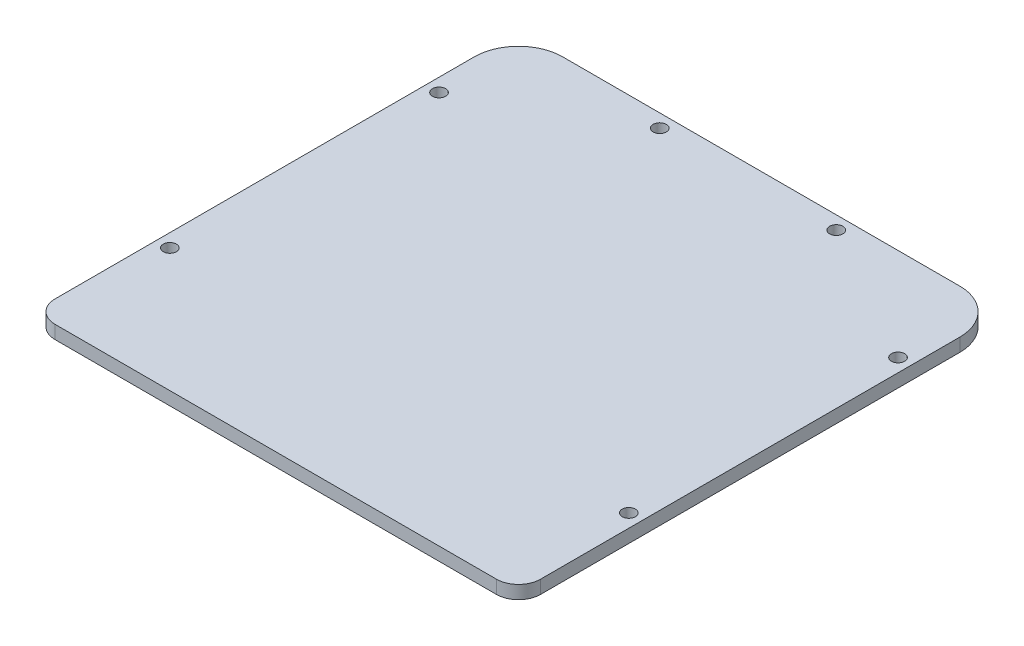
ISO-10303-21;
HEADER;
FILE_DESCRIPTION(('STEP AP214'),'2;1');
FILE_NAME('part.step','',(''),(''),'','','');
FILE_SCHEMA(('AUTOMOTIVE_DESIGN { 1 0 10303 214 1 1 1 1 }'));
ENDSEC;
DATA;
#1=APPLICATION_CONTEXT('core data for automotive mechanical design processes');
#2=APPLICATION_PROTOCOL_DEFINITION('international standard','automotive_design',2000,#1);
#3=PRODUCT_CONTEXT('',#1,'mechanical');
#4=PRODUCT('Part','Part','',(#3));
#5=PRODUCT_RELATED_PRODUCT_CATEGORY('part','',(#4));
#6=PRODUCT_DEFINITION_FORMATION('','',#4);
#7=PRODUCT_DEFINITION_CONTEXT('part definition',#1,'design');
#8=PRODUCT_DEFINITION('design','',#6,#7);
#9=PRODUCT_DEFINITION_SHAPE('','',#8);
#10=(LENGTH_UNIT() NAMED_UNIT(*) SI_UNIT(.MILLI.,.METRE.));
#11=(NAMED_UNIT(*) PLANE_ANGLE_UNIT() SI_UNIT($,.RADIAN.));
#12=(NAMED_UNIT(*) SI_UNIT($,.STERADIAN.) SOLID_ANGLE_UNIT());
#13=UNCERTAINTY_MEASURE_WITH_UNIT(LENGTH_MEASURE(1.E-05),#10,'distance_accuracy_value','');
#14=(GEOMETRIC_REPRESENTATION_CONTEXT(3) GLOBAL_UNCERTAINTY_ASSIGNED_CONTEXT((#13)) GLOBAL_UNIT_ASSIGNED_CONTEXT((#10,
#11,#12)) REPRESENTATION_CONTEXT('',''));
#15=CARTESIAN_POINT('',(0.,0.,0.));
#16=DIRECTION('',(0.,0.,1.));
#17=DIRECTION('',(1.,0.,0.));
#18=AXIS2_PLACEMENT_3D('',#15,#16,#17);
#19=CARTESIAN_POINT('',(45.3648924175193,-217.61956551421,-188.830274816639));
#20=DIRECTION('',(0.,-1.,0.));
#21=DIRECTION('',(0.,0.,-1.));
#22=AXIS2_PLACEMENT_3D('',#19,#20,#21);
#23=CYLINDRICAL_SURFACE('',#22,5.);
#24=CARTESIAN_POINT('',(45.3648924175193,-220.61956551421,-188.830274816639));
#25=DIRECTION('',(0.,1.,0.));
#26=DIRECTION('',(0.,0.,1.));
#27=AXIS2_PLACEMENT_3D('',#24,#25,#26);
#28=CIRCLE('',#27,5.);
#29=CARTESIAN_POINT('',(45.3648924175193,-220.61956551421,-183.830274816639));
#30=VERTEX_POINT('',#29);
#31=CARTESIAN_POINT('',(50.3648924175193,-220.61956551421,-188.830274816639));
#32=VERTEX_POINT('',#31);
#33=EDGE_CURVE('E131',#30,#32,#28,.T.);
#34=ORIENTED_EDGE('',*,*,#33,.T.);
#35=DIRECTION('',(0.,-1.,0.));
#36=VECTOR('',#35,1.);
#37=CARTESIAN_POINT('',(50.3648924175193,-217.61956551421,-188.830274816639));
#38=LINE('',#37,#36);
#39=CARTESIAN_POINT('',(50.3648924175193,-217.61956551421,-188.830274816639));
#40=VERTEX_POINT('',#39);
#41=EDGE_CURVE('E11',#40,#32,#38,.T.);
#42=ORIENTED_EDGE('',*,*,#41,.F.);
#43=CARTESIAN_POINT('',(45.3648924175193,-217.61956551421,-188.830274816639));
#44=DIRECTION('',(0.,1.,0.));
#45=DIRECTION('',(0.,0.,1.));
#46=AXIS2_PLACEMENT_3D('',#43,#44,#45);
#47=CIRCLE('',#46,5.);
#48=CARTESIAN_POINT('',(45.3648924175193,-217.61956551421,-183.830274816639));
#49=VERTEX_POINT('',#48);
#50=EDGE_CURVE('E146',#49,#40,#47,.T.);
#51=ORIENTED_EDGE('',*,*,#50,.F.);
#52=DIRECTION('',(0.,-1.,0.));
#53=VECTOR('',#52,1.);
#54=CARTESIAN_POINT('',(45.3648924175193,-217.61956551421,-183.830274816639));
#55=LINE('',#54,#53);
#56=EDGE_CURVE('E127',#49,#30,#55,.T.);
#57=ORIENTED_EDGE('',*,*,#56,.T.);
#58=EDGE_LOOP('',(#34,#42,#51,#57));
#59=FACE_BOUND('',#58,.T.);
#60=ADVANCED_FACE('F35',(#59),#23,.T.);
#61=CARTESIAN_POINT('',(50.3648924175193,-217.61956551421,-283.830274816639));
#62=DIRECTION('',(-1.,0.,0.));
#63=DIRECTION('',(0.,0.,1.));
#64=AXIS2_PLACEMENT_3D('',#61,#62,#63);
#65=PLANE('',#64);
#66=DIRECTION('',(0.,0.,-1.));
#67=VECTOR('',#66,1.);
#68=CARTESIAN_POINT('',(50.3648924175193,-220.61956551421,-283.830274816639));
#69=LINE('',#68,#67);
#70=CARTESIAN_POINT('',(50.3648924175193,-220.61956551421,-283.830274816639));
#71=VERTEX_POINT('',#70);
#72=EDGE_CURVE('E134',#32,#71,#69,.T.);
#73=ORIENTED_EDGE('',*,*,#72,.T.);
#74=DIRECTION('',(0.,-1.,0.));
#75=VECTOR('',#74,1.);
#76=CARTESIAN_POINT('',(50.3648924175193,-217.61956551421,-283.830274816639));
#77=LINE('',#76,#75);
#78=CARTESIAN_POINT('',(50.3648924175193,-217.61956551421,-283.830274816639));
#79=VERTEX_POINT('',#78);
#80=EDGE_CURVE('E43',#79,#71,#77,.T.);
#81=ORIENTED_EDGE('',*,*,#80,.F.);
#82=DIRECTION('',(0.,0.,-1.));
#83=VECTOR('',#82,1.);
#84=CARTESIAN_POINT('',(50.3648924175193,-217.61956551421,-283.830274816639));
#85=LINE('',#84,#83);
#86=EDGE_CURVE('E94',#40,#79,#85,.T.);
#87=ORIENTED_EDGE('',*,*,#86,.F.);
#88=ORIENTED_EDGE('',*,*,#41,.T.);
#89=EDGE_LOOP('',(#73,#81,#87,#88));
#90=FACE_BOUND('',#89,.T.);
#91=ADVANCED_FACE('F243',(#90),#65,.F.);
#92=CARTESIAN_POINT('',(40.3648924175193,-217.61956551421,-283.830274816639));
#93=DIRECTION('',(0.,-1.,0.));
#94=DIRECTION('',(0.,0.,-1.));
#95=AXIS2_PLACEMENT_3D('',#92,#93,#94);
#96=CYLINDRICAL_SURFACE('',#95,10.);
#97=CARTESIAN_POINT('',(40.3648924175193,-220.61956551421,-283.830274816639));
#98=DIRECTION('',(0.,1.,0.));
#99=DIRECTION('',(0.,0.,-1.));
#100=AXIS2_PLACEMENT_3D('',#97,#98,#99);
#101=CIRCLE('',#100,10.);
#102=CARTESIAN_POINT('',(40.3648924175193,-220.61956551421,-293.830274816639));
#103=VERTEX_POINT('',#102);
#104=EDGE_CURVE('E137',#71,#103,#101,.T.);
#105=ORIENTED_EDGE('',*,*,#104,.T.);
#106=DIRECTION('',(0.,-1.,0.));
#107=VECTOR('',#106,1.);
#108=CARTESIAN_POINT('',(40.3648924175193,-217.61956551421,-293.830274816639));
#109=LINE('',#108,#107);
#110=CARTESIAN_POINT('',(40.3648924175193,-217.61956551421,-293.830274816639));
#111=VERTEX_POINT('',#110);
#112=EDGE_CURVE('E153',#111,#103,#109,.T.);
#113=ORIENTED_EDGE('',*,*,#112,.F.);
#114=CARTESIAN_POINT('',(40.3648924175193,-217.61956551421,-283.830274816639));
#115=DIRECTION('',(0.,1.,0.));
#116=DIRECTION('',(0.,0.,-1.));
#117=AXIS2_PLACEMENT_3D('',#114,#115,#116);
#118=CIRCLE('',#117,10.);
#119=EDGE_CURVE('E161',#79,#111,#118,.T.);
#120=ORIENTED_EDGE('',*,*,#119,.F.);
#121=ORIENTED_EDGE('',*,*,#80,.T.);
#122=EDGE_LOOP('',(#105,#113,#120,#121));
#123=FACE_BOUND('',#122,.T.);
#124=ADVANCED_FACE('F159',(#123),#96,.T.);
#125=CARTESIAN_POINT('',(-49.6351075824806,-217.61956551421,-293.830274816639));
#126=DIRECTION('',(0.,0.,1.));
#127=DIRECTION('',(1.,0.,0.));
#128=AXIS2_PLACEMENT_3D('',#125,#126,#127);
#129=PLANE('',#128);
#130=DIRECTION('',(-1.,0.,0.));
#131=VECTOR('',#130,1.);
#132=CARTESIAN_POINT('',(-49.6351075824806,-220.61956551421,-293.830274816639));
#133=LINE('',#132,#131);
#134=CARTESIAN_POINT('',(-49.6351075824806,-220.61956551421,-293.830274816639));
#135=VERTEX_POINT('',#134);
#136=EDGE_CURVE('E139',#103,#135,#133,.T.);
#137=ORIENTED_EDGE('',*,*,#136,.T.);
#138=DIRECTION('',(0.,-1.,0.));
#139=VECTOR('',#138,1.);
#140=CARTESIAN_POINT('',(-49.6351075824806,-217.61956551421,-293.830274816639));
#141=LINE('',#140,#139);
#142=CARTESIAN_POINT('',(-49.6351075824806,-217.61956551421,-293.830274816639));
#143=VERTEX_POINT('',#142);
#144=EDGE_CURVE('E150',#143,#135,#141,.T.);
#145=ORIENTED_EDGE('',*,*,#144,.F.);
#146=DIRECTION('',(-1.,0.,0.));
#147=VECTOR('',#146,1.);
#148=CARTESIAN_POINT('',(-49.6351075824806,-217.61956551421,-293.830274816639));
#149=LINE('',#148,#147);
#150=EDGE_CURVE('E173',#111,#143,#149,.T.);
#151=ORIENTED_EDGE('',*,*,#150,.F.);
#152=ORIENTED_EDGE('',*,*,#112,.T.);
#153=EDGE_LOOP('',(#137,#145,#151,#152));
#154=FACE_BOUND('',#153,.T.);
#155=ADVANCED_FACE('F169',(#154),#129,.F.);
#156=CARTESIAN_POINT('',(-49.6351075824807,-217.61956551421,-283.830274816639));
#157=DIRECTION('',(0.,-1.,0.));
#158=DIRECTION('',(0.,0.,-1.));
#159=AXIS2_PLACEMENT_3D('',#156,#157,#158);
#160=CYLINDRICAL_SURFACE('',#159,10.);
#161=CARTESIAN_POINT('',(-49.6351075824807,-220.61956551421,-283.830274816639));
#162=DIRECTION('',(0.,1.,0.));
#163=DIRECTION('',(0.,0.,1.));
#164=AXIS2_PLACEMENT_3D('',#161,#162,#163);
#165=CIRCLE('',#164,10.);
#166=CARTESIAN_POINT('',(-59.6351075824807,-220.61956551421,-283.830274816639));
#167=VERTEX_POINT('',#166);
#168=EDGE_CURVE('E141',#135,#167,#165,.T.);
#169=ORIENTED_EDGE('',*,*,#168,.T.);
#170=DIRECTION('',(0.,-1.,0.));
#171=VECTOR('',#170,1.);
#172=CARTESIAN_POINT('',(-59.6351075824807,-217.61956551421,-283.830274816639));
#173=LINE('',#172,#171);
#174=CARTESIAN_POINT('',(-59.6351075824807,-217.61956551421,-283.830274816639));
#175=VERTEX_POINT('',#174);
#176=EDGE_CURVE('E122',#175,#167,#173,.T.);
#177=ORIENTED_EDGE('',*,*,#176,.F.);
#178=CARTESIAN_POINT('',(-49.6351075824807,-217.61956551421,-283.830274816639));
#179=DIRECTION('',(0.,1.,0.));
#180=DIRECTION('',(0.,0.,1.));
#181=AXIS2_PLACEMENT_3D('',#178,#179,#180);
#182=CIRCLE('',#181,10.);
#183=EDGE_CURVE('E113',#143,#175,#182,.T.);
#184=ORIENTED_EDGE('',*,*,#183,.F.);
#185=ORIENTED_EDGE('',*,*,#144,.T.);
#186=EDGE_LOOP('',(#169,#177,#184,#185));
#187=FACE_BOUND('',#186,.T.);
#188=ADVANCED_FACE('F172',(#187),#160,.T.);
#189=CARTESIAN_POINT('',(-59.6351075824807,-217.61956551421,-283.830274816639));
#190=DIRECTION('',(1.,0.,0.));
#191=DIRECTION('',(0.,0.,-1.));
#192=AXIS2_PLACEMENT_3D('',#189,#190,#191);
#193=PLANE('',#192);
#194=DIRECTION('',(0.,0.,1.));
#195=VECTOR('',#194,1.);
#196=CARTESIAN_POINT('',(-59.6351075824807,-220.61956551421,-283.830274816639));
#197=LINE('',#196,#195);
#198=CARTESIAN_POINT('',(-59.6351075824807,-220.61956551421,-188.830274816639));
#199=VERTEX_POINT('',#198);
#200=EDGE_CURVE('E121',#167,#199,#197,.T.);
#201=ORIENTED_EDGE('',*,*,#200,.T.);
#202=DIRECTION('',(0.,-1.,0.));
#203=VECTOR('',#202,1.);
#204=CARTESIAN_POINT('',(-59.6351075824807,-217.61956551421,-188.830274816639));
#205=LINE('',#204,#203);
#206=CARTESIAN_POINT('',(-59.6351075824807,-217.61956551421,-188.830274816639));
#207=VERTEX_POINT('',#206);
#208=EDGE_CURVE('E118',#207,#199,#205,.T.);
#209=ORIENTED_EDGE('',*,*,#208,.F.);
#210=DIRECTION('',(0.,0.,1.));
#211=VECTOR('',#210,1.);
#212=CARTESIAN_POINT('',(-59.6351075824807,-217.61956551421,-283.830274816639));
#213=LINE('',#212,#211);
#214=EDGE_CURVE('E107',#175,#207,#213,.T.);
#215=ORIENTED_EDGE('',*,*,#214,.F.);
#216=ORIENTED_EDGE('',*,*,#176,.T.);
#217=EDGE_LOOP('',(#201,#209,#215,#216));
#218=FACE_BOUND('',#217,.T.);
#219=ADVANCED_FACE('F119',(#218),#193,.F.);
#220=CARTESIAN_POINT('',(-54.6351075824807,-217.61956551421,-188.830274816639));
#221=DIRECTION('',(0.,-1.,0.));
#222=DIRECTION('',(0.,0.,-1.));
#223=AXIS2_PLACEMENT_3D('',#220,#221,#222);
#224=CYLINDRICAL_SURFACE('',#223,5.);
#225=CARTESIAN_POINT('',(-54.6351075824807,-220.61956551421,-188.830274816639));
#226=DIRECTION('',(0.,1.,0.));
#227=DIRECTION('',(0.,0.,1.));
#228=AXIS2_PLACEMENT_3D('',#225,#226,#227);
#229=CIRCLE('',#228,5.);
#230=CARTESIAN_POINT('',(-54.6351075824806,-220.61956551421,-183.830274816639));
#231=VERTEX_POINT('',#230);
#232=EDGE_CURVE('E80',#199,#231,#229,.T.);
#233=ORIENTED_EDGE('',*,*,#232,.T.);
#234=DIRECTION('',(0.,-1.,0.));
#235=VECTOR('',#234,1.);
#236=CARTESIAN_POINT('',(-54.6351075824806,-217.61956551421,-183.830274816639));
#237=LINE('',#236,#235);
#238=CARTESIAN_POINT('',(-54.6351075824806,-217.61956551421,-183.830274816639));
#239=VERTEX_POINT('',#238);
#240=EDGE_CURVE('E123',#239,#231,#237,.T.);
#241=ORIENTED_EDGE('',*,*,#240,.F.);
#242=CARTESIAN_POINT('',(-54.6351075824807,-217.61956551421,-188.830274816639));
#243=DIRECTION('',(0.,1.,0.));
#244=DIRECTION('',(0.,0.,1.));
#245=AXIS2_PLACEMENT_3D('',#242,#243,#244);
#246=CIRCLE('',#245,5.);
#247=EDGE_CURVE('E111',#207,#239,#246,.T.);
#248=ORIENTED_EDGE('',*,*,#247,.F.);
#249=ORIENTED_EDGE('',*,*,#208,.T.);
#250=EDGE_LOOP('',(#233,#241,#248,#249));
#251=FACE_BOUND('',#250,.T.);
#252=ADVANCED_FACE('F125',(#251),#224,.T.);
#253=CARTESIAN_POINT('',(-54.6351075824806,-217.61956551421,-183.830274816639));
#254=DIRECTION('',(0.,0.,-1.));
#255=DIRECTION('',(-1.,0.,0.));
#256=AXIS2_PLACEMENT_3D('',#253,#254,#255);
#257=PLANE('',#256);
#258=DIRECTION('',(1.,0.,0.));
#259=VECTOR('',#258,1.);
#260=CARTESIAN_POINT('',(-54.6351075824806,-220.61956551421,-183.830274816639));
#261=LINE('',#260,#259);
#262=EDGE_CURVE('E86',#231,#30,#261,.T.);
#263=ORIENTED_EDGE('',*,*,#262,.T.);
#264=ORIENTED_EDGE('',*,*,#56,.F.);
#265=DIRECTION('',(1.,0.,0.));
#266=VECTOR('',#265,1.);
#267=CARTESIAN_POINT('',(-54.6351075824806,-217.61956551421,-183.830274816639));
#268=LINE('',#267,#266);
#269=EDGE_CURVE('E51',#239,#49,#268,.T.);
#270=ORIENTED_EDGE('',*,*,#269,.F.);
#271=ORIENTED_EDGE('',*,*,#240,.T.);
#272=EDGE_LOOP('',(#263,#264,#270,#271));
#273=FACE_BOUND('',#272,.T.);
#274=ADVANCED_FACE('F227',(#273),#257,.F.);
#275=CARTESIAN_POINT('',(45.3648924175193,-217.61956551421,-188.830274816639));
#276=DIRECTION('',(0.,1.,0.));
#277=DIRECTION('',(0.,0.,1.));
#278=AXIS2_PLACEMENT_3D('',#275,#276,#277);
#279=PLANE('',#278);
#280=CARTESIAN_POINT('',(15.3648924175192,-217.61956551421,-290.833255232378));
#281=DIRECTION('',(0.,1.,0.));
#282=DIRECTION('',(0.,0.,1.));
#283=AXIS2_PLACEMENT_3D('',#280,#281,#282);
#284=CIRCLE('',#283,1.5);
#285=CARTESIAN_POINT('',(15.3648924175192,-217.61956551421,-289.333255232378));
#286=VERTEX_POINT('',#285);
#287=EDGE_CURVE('E204',#286,#286,#284,.T.);
#288=ORIENTED_EDGE('',*,*,#287,.F.);
#289=EDGE_LOOP('',(#288));
#290=FACE_BOUND('',#289,.T.);
#291=CARTESIAN_POINT('',(47.3648924175181,-217.61956551421,-272.830274816639));
#292=DIRECTION('',(0.,1.,0.));
#293=DIRECTION('',(0.,0.,1.));
#294=AXIS2_PLACEMENT_3D('',#291,#292,#293);
#295=CIRCLE('',#294,1.49999999999998);
#296=CARTESIAN_POINT('',(47.3648924175181,-217.61956551421,-271.330274816639));
#297=VERTEX_POINT('',#296);
#298=EDGE_CURVE('E198',#297,#297,#295,.T.);
#299=ORIENTED_EDGE('',*,*,#298,.F.);
#300=EDGE_LOOP('',(#299));
#301=FACE_BOUND('',#300,.T.);
#302=CARTESIAN_POINT('',(47.3648924175193,-217.61956551421,-211.830274816639));
#303=DIRECTION('',(0.,1.,0.));
#304=DIRECTION('',(0.,0.,1.));
#305=AXIS2_PLACEMENT_3D('',#302,#303,#304);
#306=CIRCLE('',#305,1.5);
#307=CARTESIAN_POINT('',(47.3648924175193,-217.61956551421,-210.330274816639));
#308=VERTEX_POINT('',#307);
#309=EDGE_CURVE('E192',#308,#308,#306,.T.);
#310=ORIENTED_EDGE('',*,*,#309,.F.);
#311=EDGE_LOOP('',(#310));
#312=FACE_BOUND('',#311,.T.);
#313=CARTESIAN_POINT('',(-56.6351075824807,-217.61956551421,-211.830274816639));
#314=DIRECTION('',(0.,1.,0.));
#315=DIRECTION('',(0.,0.,1.));
#316=AXIS2_PLACEMENT_3D('',#313,#314,#315);
#317=CIRCLE('',#316,1.5);
#318=CARTESIAN_POINT('',(-56.6351075824807,-217.61956551421,-210.330274816639));
#319=VERTEX_POINT('',#318);
#320=EDGE_CURVE('E185',#319,#319,#317,.T.);
#321=ORIENTED_EDGE('',*,*,#320,.F.);
#322=EDGE_LOOP('',(#321));
#323=FACE_BOUND('',#322,.T.);
#324=CARTESIAN_POINT('',(-56.6351075824807,-217.61956551421,-272.830274816639));
#325=DIRECTION('',(0.,1.,0.));
#326=DIRECTION('',(0.,0.,1.));
#327=AXIS2_PLACEMENT_3D('',#324,#325,#326);
#328=CIRCLE('',#327,1.50000000000001);
#329=CARTESIAN_POINT('',(-56.6351075824807,-217.61956551421,-271.330274816639));
#330=VERTEX_POINT('',#329);
#331=EDGE_CURVE('E209',#330,#330,#328,.T.);
#332=ORIENTED_EDGE('',*,*,#331,.F.);
#333=EDGE_LOOP('',(#332));
#334=FACE_BOUND('',#333,.T.);
#335=CARTESIAN_POINT('',(-24.6351075824807,-217.61956551421,-290.833255232378));
#336=DIRECTION('',(0.,1.,0.));
#337=DIRECTION('',(0.,0.,1.));
#338=AXIS2_PLACEMENT_3D('',#335,#336,#337);
#339=CIRCLE('',#338,1.49999999999997);
#340=CARTESIAN_POINT('',(-24.6351075824807,-217.61956551421,-289.333255232378));
#341=VERTEX_POINT('',#340);
#342=EDGE_CURVE('E179',#341,#341,#339,.T.);
#343=ORIENTED_EDGE('',*,*,#342,.F.);
#344=EDGE_LOOP('',(#343));
#345=FACE_BOUND('',#344,.T.);
#346=ORIENTED_EDGE('',*,*,#50,.T.);
#347=ORIENTED_EDGE('',*,*,#86,.T.);
#348=ORIENTED_EDGE('',*,*,#119,.T.);
#349=ORIENTED_EDGE('',*,*,#150,.T.);
#350=ORIENTED_EDGE('',*,*,#183,.T.);
#351=ORIENTED_EDGE('',*,*,#214,.T.);
#352=ORIENTED_EDGE('',*,*,#247,.T.);
#353=ORIENTED_EDGE('',*,*,#269,.T.);
#354=EDGE_LOOP('',(#346,#347,#348,#349,#350,#351,#352,#353));
#355=FACE_BOUND('',#354,.T.);
#356=ADVANCED_FACE('F109',(#290,#301,#312,#323,#334,#345,#355),#279,.T.);
#357=CARTESIAN_POINT('',(45.3648924175193,-220.61956551421,-188.830274816639));
#358=DIRECTION('',(0.,1.,0.));
#359=DIRECTION('',(0.,0.,1.));
#360=AXIS2_PLACEMENT_3D('',#357,#358,#359);
#361=PLANE('',#360);
#362=CARTESIAN_POINT('',(15.3648924175192,-220.61956551421,-290.833255232378));
#363=DIRECTION('',(0.,1.,0.));
#364=DIRECTION('',(0.,0.,1.));
#365=AXIS2_PLACEMENT_3D('',#362,#363,#364);
#366=CIRCLE('',#365,1.5);
#367=CARTESIAN_POINT('',(15.3648924175192,-220.61956551421,-289.333255232378));
#368=VERTEX_POINT('',#367);
#369=EDGE_CURVE('E182',#368,#368,#366,.T.);
#370=ORIENTED_EDGE('',*,*,#369,.T.);
#371=EDGE_LOOP('',(#370));
#372=FACE_BOUND('',#371,.T.);
#373=CARTESIAN_POINT('',(47.3648924175181,-220.61956551421,-272.830274816639));
#374=DIRECTION('',(0.,1.,0.));
#375=DIRECTION('',(0.,0.,1.));
#376=AXIS2_PLACEMENT_3D('',#373,#374,#375);
#377=CIRCLE('',#376,1.49999999999998);
#378=CARTESIAN_POINT('',(47.3648924175181,-220.61956551421,-271.330274816639));
#379=VERTEX_POINT('',#378);
#380=EDGE_CURVE('E201',#379,#379,#377,.T.);
#381=ORIENTED_EDGE('',*,*,#380,.T.);
#382=EDGE_LOOP('',(#381));
#383=FACE_BOUND('',#382,.T.);
#384=CARTESIAN_POINT('',(47.3648924175193,-220.61956551421,-211.830274816639));
#385=DIRECTION('',(0.,1.,0.));
#386=DIRECTION('',(0.,0.,1.));
#387=AXIS2_PLACEMENT_3D('',#384,#385,#386);
#388=CIRCLE('',#387,1.5);
#389=CARTESIAN_POINT('',(47.3648924175193,-220.61956551421,-210.330274816639));
#390=VERTEX_POINT('',#389);
#391=EDGE_CURVE('E195',#390,#390,#388,.T.);
#392=ORIENTED_EDGE('',*,*,#391,.T.);
#393=EDGE_LOOP('',(#392));
#394=FACE_BOUND('',#393,.T.);
#395=CARTESIAN_POINT('',(-56.6351075824807,-220.61956551421,-211.830274816639));
#396=DIRECTION('',(0.,1.,0.));
#397=DIRECTION('',(0.,0.,1.));
#398=AXIS2_PLACEMENT_3D('',#395,#396,#397);
#399=CIRCLE('',#398,1.5);
#400=CARTESIAN_POINT('',(-56.6351075824807,-220.61956551421,-210.330274816639));
#401=VERTEX_POINT('',#400);
#402=EDGE_CURVE('E188',#401,#401,#399,.T.);
#403=ORIENTED_EDGE('',*,*,#402,.T.);
#404=EDGE_LOOP('',(#403));
#405=FACE_BOUND('',#404,.T.);
#406=CARTESIAN_POINT('',(-56.6351075824807,-220.61956551421,-272.830274816639));
#407=DIRECTION('',(0.,1.,0.));
#408=DIRECTION('',(0.,0.,1.));
#409=AXIS2_PLACEMENT_3D('',#406,#407,#408);
#410=CIRCLE('',#409,1.50000000000001);
#411=CARTESIAN_POINT('',(-56.6351075824807,-220.61956551421,-271.330274816639));
#412=VERTEX_POINT('',#411);
#413=EDGE_CURVE('E189',#412,#412,#410,.T.);
#414=ORIENTED_EDGE('',*,*,#413,.T.);
#415=EDGE_LOOP('',(#414));
#416=FACE_BOUND('',#415,.T.);
#417=CARTESIAN_POINT('',(-24.6351075824807,-220.61956551421,-290.833255232378));
#418=DIRECTION('',(0.,1.,0.));
#419=DIRECTION('',(0.,0.,1.));
#420=AXIS2_PLACEMENT_3D('',#417,#418,#419);
#421=CIRCLE('',#420,1.49999999999997);
#422=CARTESIAN_POINT('',(-24.6351075824807,-220.61956551421,-289.333255232378));
#423=VERTEX_POINT('',#422);
#424=EDGE_CURVE('E135',#423,#423,#421,.T.);
#425=ORIENTED_EDGE('',*,*,#424,.T.);
#426=EDGE_LOOP('',(#425));
#427=FACE_BOUND('',#426,.T.);
#428=ORIENTED_EDGE('',*,*,#33,.F.);
#429=ORIENTED_EDGE('',*,*,#262,.F.);
#430=ORIENTED_EDGE('',*,*,#232,.F.);
#431=ORIENTED_EDGE('',*,*,#200,.F.);
#432=ORIENTED_EDGE('',*,*,#168,.F.);
#433=ORIENTED_EDGE('',*,*,#136,.F.);
#434=ORIENTED_EDGE('',*,*,#104,.F.);
#435=ORIENTED_EDGE('',*,*,#72,.F.);
#436=EDGE_LOOP('',(#428,#429,#430,#431,#432,#433,#434,#435));
#437=FACE_BOUND('',#436,.T.);
#438=ADVANCED_FACE('F165',(#372,#383,#394,#405,#416,#427,#437),#361,.F.);
#439=CARTESIAN_POINT('',(-24.6351075824807,-220.61956551421,-290.833255232378));
#440=DIRECTION('',(0.,1.,0.));
#441=DIRECTION('',(0.,0.,1.));
#442=AXIS2_PLACEMENT_3D('',#439,#440,#441);
#443=CYLINDRICAL_SURFACE('',#442,1.49999999999997);
#444=ORIENTED_EDGE('',*,*,#424,.F.);
#445=EDGE_LOOP('',(#444));
#446=FACE_BOUND('',#445,.T.);
#447=ORIENTED_EDGE('',*,*,#342,.T.);
#448=EDGE_LOOP('',(#447));
#449=FACE_BOUND('',#448,.T.);
#450=ADVANCED_FACE('F221',(#446,#449),#443,.F.);
#451=CARTESIAN_POINT('',(-56.6351075824807,-220.61956551421,-272.830274816639));
#452=DIRECTION('',(0.,1.,0.));
#453=DIRECTION('',(0.,0.,1.));
#454=AXIS2_PLACEMENT_3D('',#451,#452,#453);
#455=CYLINDRICAL_SURFACE('',#454,1.50000000000001);
#456=ORIENTED_EDGE('',*,*,#413,.F.);
#457=EDGE_LOOP('',(#456));
#458=FACE_BOUND('',#457,.T.);
#459=ORIENTED_EDGE('',*,*,#331,.T.);
#460=EDGE_LOOP('',(#459));
#461=FACE_BOUND('',#460,.T.);
#462=ADVANCED_FACE('F217',(#458,#461),#455,.F.);
#463=CARTESIAN_POINT('',(-56.6351075824807,-220.61956551421,-211.830274816639));
#464=DIRECTION('',(0.,1.,0.));
#465=DIRECTION('',(0.,0.,1.));
#466=AXIS2_PLACEMENT_3D('',#463,#464,#465);
#467=CYLINDRICAL_SURFACE('',#466,1.5);
#468=ORIENTED_EDGE('',*,*,#402,.F.);
#469=EDGE_LOOP('',(#468));
#470=FACE_BOUND('',#469,.T.);
#471=ORIENTED_EDGE('',*,*,#320,.T.);
#472=EDGE_LOOP('',(#471));
#473=FACE_BOUND('',#472,.T.);
#474=ADVANCED_FACE('F220',(#470,#473),#467,.F.);
#475=CARTESIAN_POINT('',(47.3648924175193,-220.61956551421,-211.830274816639));
#476=DIRECTION('',(0.,1.,0.));
#477=DIRECTION('',(0.,0.,1.));
#478=AXIS2_PLACEMENT_3D('',#475,#476,#477);
#479=CYLINDRICAL_SURFACE('',#478,1.5);
#480=ORIENTED_EDGE('',*,*,#391,.F.);
#481=EDGE_LOOP('',(#480));
#482=FACE_BOUND('',#481,.T.);
#483=ORIENTED_EDGE('',*,*,#309,.T.);
#484=EDGE_LOOP('',(#483));
#485=FACE_BOUND('',#484,.T.);
#486=ADVANCED_FACE('F319',(#482,#485),#479,.F.);
#487=CARTESIAN_POINT('',(47.3648924175181,-220.61956551421,-272.830274816639));
#488=DIRECTION('',(0.,1.,0.));
#489=DIRECTION('',(0.,0.,1.));
#490=AXIS2_PLACEMENT_3D('',#487,#488,#489);
#491=CYLINDRICAL_SURFACE('',#490,1.49999999999998);
#492=ORIENTED_EDGE('',*,*,#380,.F.);
#493=EDGE_LOOP('',(#492));
#494=FACE_BOUND('',#493,.T.);
#495=ORIENTED_EDGE('',*,*,#298,.T.);
#496=EDGE_LOOP('',(#495));
#497=FACE_BOUND('',#496,.T.);
#498=ADVANCED_FACE('F328',(#494,#497),#491,.F.);
#499=CARTESIAN_POINT('',(15.3648924175192,-220.61956551421,-290.833255232378));
#500=DIRECTION('',(0.,1.,0.));
#501=DIRECTION('',(0.,0.,1.));
#502=AXIS2_PLACEMENT_3D('',#499,#500,#501);
#503=CYLINDRICAL_SURFACE('',#502,1.5);
#504=ORIENTED_EDGE('',*,*,#369,.F.);
#505=EDGE_LOOP('',(#504));
#506=FACE_BOUND('',#505,.T.);
#507=ORIENTED_EDGE('',*,*,#287,.T.);
#508=EDGE_LOOP('',(#507));
#509=FACE_BOUND('',#508,.T.);
#510=ADVANCED_FACE('F338',(#506,#509),#503,.F.);
#511=CLOSED_SHELL('',(#60,#91,#124,#155,#188,#219,#252,#274,#356,#438,#450,#462,#474,#486,#498,#510));
#512=MANIFOLD_SOLID_BREP('B2',#511);
#513=ADVANCED_BREP_SHAPE_REPRESENTATION('',(#18,#512),#14);
#514=SHAPE_DEFINITION_REPRESENTATION(#9,#513);
ENDSEC;
END-ISO-10303-21;
